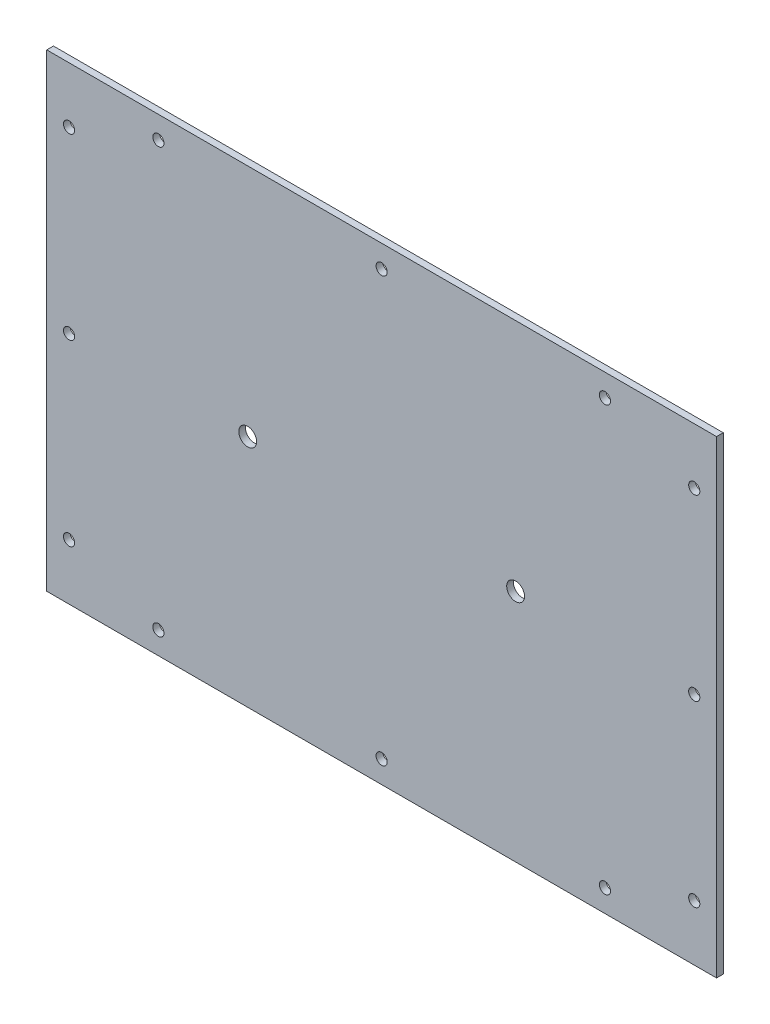
ISO-10303-21;
HEADER;
FILE_DESCRIPTION(('STEP AP214'),'2;1');
FILE_NAME('part.step','',(''),(''),'','','');
FILE_SCHEMA(('AUTOMOTIVE_DESIGN { 1 0 10303 214 1 1 1 1 }'));
ENDSEC;
DATA;
#1=APPLICATION_CONTEXT('core data for automotive mechanical design processes');
#2=APPLICATION_PROTOCOL_DEFINITION('international standard','automotive_design',2000,#1);
#3=PRODUCT_CONTEXT('',#1,'mechanical');
#4=PRODUCT('Part','Part','',(#3));
#5=PRODUCT_RELATED_PRODUCT_CATEGORY('part','',(#4));
#6=PRODUCT_DEFINITION_FORMATION('','',#4);
#7=PRODUCT_DEFINITION_CONTEXT('part definition',#1,'design');
#8=PRODUCT_DEFINITION('design','',#6,#7);
#9=PRODUCT_DEFINITION_SHAPE('','',#8);
#10=(LENGTH_UNIT() NAMED_UNIT(*) SI_UNIT(.MILLI.,.METRE.));
#11=(NAMED_UNIT(*) PLANE_ANGLE_UNIT() SI_UNIT($,.RADIAN.));
#12=(NAMED_UNIT(*) SI_UNIT($,.STERADIAN.) SOLID_ANGLE_UNIT());
#13=UNCERTAINTY_MEASURE_WITH_UNIT(LENGTH_MEASURE(1.E-05),#10,'distance_accuracy_value','');
#14=(GEOMETRIC_REPRESENTATION_CONTEXT(3) GLOBAL_UNCERTAINTY_ASSIGNED_CONTEXT((#13)) GLOBAL_UNIT_ASSIGNED_CONTEXT((#10,
#11,#12)) REPRESENTATION_CONTEXT('',''));
#15=CARTESIAN_POINT('',(0.,0.,0.));
#16=DIRECTION('',(0.,0.,1.));
#17=DIRECTION('',(1.,0.,0.));
#18=AXIS2_PLACEMENT_3D('',#15,#16,#17);
#19=CARTESIAN_POINT('',(150.,105.,3.));
#20=DIRECTION('',(-1.,0.,0.));
#21=DIRECTION('',(0.,0.,1.));
#22=AXIS2_PLACEMENT_3D('',#19,#20,#21);
#23=PLANE('',#22);
#24=DIRECTION('',(0.,1.,0.));
#25=VECTOR('',#24,1.);
#26=CARTESIAN_POINT('',(150.,105.,0.));
#27=LINE('',#26,#25);
#28=CARTESIAN_POINT('',(150.,-105.,0.));
#29=VERTEX_POINT('',#28);
#30=CARTESIAN_POINT('',(150.,105.,0.));
#31=VERTEX_POINT('',#30);
#32=EDGE_CURVE('E109',#29,#31,#27,.T.);
#33=ORIENTED_EDGE('',*,*,#32,.T.);
#34=DIRECTION('',(0.,0.,-1.));
#35=VECTOR('',#34,1.);
#36=CARTESIAN_POINT('',(150.,105.,3.));
#37=LINE('',#36,#35);
#38=CARTESIAN_POINT('',(150.,105.,3.));
#39=VERTEX_POINT('',#38);
#40=EDGE_CURVE('E11',#39,#31,#37,.T.);
#41=ORIENTED_EDGE('',*,*,#40,.F.);
#42=DIRECTION('',(0.,1.,0.));
#43=VECTOR('',#42,1.);
#44=CARTESIAN_POINT('',(150.,105.,3.));
#45=LINE('',#44,#43);
#46=CARTESIAN_POINT('',(150.,-105.,3.));
#47=VERTEX_POINT('',#46);
#48=EDGE_CURVE('E93',#47,#39,#45,.T.);
#49=ORIENTED_EDGE('',*,*,#48,.F.);
#50=DIRECTION('',(0.,0.,-1.));
#51=VECTOR('',#50,1.);
#52=CARTESIAN_POINT('',(150.,-105.,3.));
#53=LINE('',#52,#51);
#54=EDGE_CURVE('E105',#47,#29,#53,.T.);
#55=ORIENTED_EDGE('',*,*,#54,.T.);
#56=EDGE_LOOP('',(#33,#41,#49,#55));
#57=FACE_BOUND('',#56,.T.);
#58=ADVANCED_FACE('F41',(#57),#23,.F.);
#59=CARTESIAN_POINT('',(-150.,105.,3.));
#60=DIRECTION('',(0.,-1.,0.));
#61=DIRECTION('',(0.,0.,-1.));
#62=AXIS2_PLACEMENT_3D('',#59,#60,#61);
#63=PLANE('',#62);
#64=DIRECTION('',(-1.,0.,0.));
#65=VECTOR('',#64,1.);
#66=CARTESIAN_POINT('',(-150.,105.,0.));
#67=LINE('',#66,#65);
#68=CARTESIAN_POINT('',(-150.,105.,0.));
#69=VERTEX_POINT('',#68);
#70=EDGE_CURVE('E98',#31,#69,#67,.T.);
#71=ORIENTED_EDGE('',*,*,#70,.T.);
#72=DIRECTION('',(0.,0.,-1.));
#73=VECTOR('',#72,1.);
#74=CARTESIAN_POINT('',(-150.,105.,3.));
#75=LINE('',#74,#73);
#76=CARTESIAN_POINT('',(-150.,105.,3.));
#77=VERTEX_POINT('',#76);
#78=EDGE_CURVE('E50',#77,#69,#75,.T.);
#79=ORIENTED_EDGE('',*,*,#78,.F.);
#80=DIRECTION('',(-1.,0.,0.));
#81=VECTOR('',#80,1.);
#82=CARTESIAN_POINT('',(-150.,105.,3.));
#83=LINE('',#82,#81);
#84=EDGE_CURVE('E88',#39,#77,#83,.T.);
#85=ORIENTED_EDGE('',*,*,#84,.F.);
#86=ORIENTED_EDGE('',*,*,#40,.T.);
#87=EDGE_LOOP('',(#71,#79,#85,#86));
#88=FACE_BOUND('',#87,.T.);
#89=ADVANCED_FACE('F97',(#88),#63,.F.);
#90=CARTESIAN_POINT('',(-150.,105.,3.));
#91=DIRECTION('',(1.,0.,0.));
#92=DIRECTION('',(0.,1.,0.));
#93=AXIS2_PLACEMENT_3D('',#90,#91,#92);
#94=PLANE('',#93);
#95=DIRECTION('',(0.,-1.,0.));
#96=VECTOR('',#95,1.);
#97=CARTESIAN_POINT('',(-150.,105.,0.));
#98=LINE('',#97,#96);
#99=CARTESIAN_POINT('',(-150.,-105.,0.));
#100=VERTEX_POINT('',#99);
#101=EDGE_CURVE('E75',#69,#100,#98,.T.);
#102=ORIENTED_EDGE('',*,*,#101,.T.);
#103=DIRECTION('',(0.,0.,-1.));
#104=VECTOR('',#103,1.);
#105=CARTESIAN_POINT('',(-150.,-105.,3.));
#106=LINE('',#105,#104);
#107=CARTESIAN_POINT('',(-150.,-105.,3.));
#108=VERTEX_POINT('',#107);
#109=EDGE_CURVE('E100',#108,#100,#106,.T.);
#110=ORIENTED_EDGE('',*,*,#109,.F.);
#111=DIRECTION('',(0.,-1.,0.));
#112=VECTOR('',#111,1.);
#113=CARTESIAN_POINT('',(-150.,105.,3.));
#114=LINE('',#113,#112);
#115=EDGE_CURVE('E91',#77,#108,#114,.T.);
#116=ORIENTED_EDGE('',*,*,#115,.F.);
#117=ORIENTED_EDGE('',*,*,#78,.T.);
#118=EDGE_LOOP('',(#102,#110,#116,#117));
#119=FACE_BOUND('',#118,.T.);
#120=ADVANCED_FACE('F101',(#119),#94,.F.);
#121=CARTESIAN_POINT('',(-150.,-105.,3.));
#122=DIRECTION('',(0.,1.,0.));
#123=DIRECTION('',(0.,0.,1.));
#124=AXIS2_PLACEMENT_3D('',#121,#122,#123);
#125=PLANE('',#124);
#126=DIRECTION('',(1.,0.,0.));
#127=VECTOR('',#126,1.);
#128=CARTESIAN_POINT('',(-150.,-105.,0.));
#129=LINE('',#128,#127);
#130=EDGE_CURVE('E81',#100,#29,#129,.T.);
#131=ORIENTED_EDGE('',*,*,#130,.T.);
#132=ORIENTED_EDGE('',*,*,#54,.F.);
#133=DIRECTION('',(1.,0.,0.));
#134=VECTOR('',#133,1.);
#135=CARTESIAN_POINT('',(-150.,-105.,3.));
#136=LINE('',#135,#134);
#137=EDGE_CURVE('E58',#108,#47,#136,.T.);
#138=ORIENTED_EDGE('',*,*,#137,.F.);
#139=ORIENTED_EDGE('',*,*,#109,.T.);
#140=EDGE_LOOP('',(#131,#132,#138,#139));
#141=FACE_BOUND('',#140,.T.);
#142=ADVANCED_FACE('F123',(#141),#125,.F.);
#143=CARTESIAN_POINT('',(0.,0.,3.));
#144=DIRECTION('',(0.,0.,1.));
#145=DIRECTION('',(1.,0.,0.));
#146=AXIS2_PLACEMENT_3D('',#143,#144,#145);
#147=PLANE('',#146);
#148=CARTESIAN_POINT('',(60.,0.,3.));
#149=DIRECTION('',(0.,0.,1.));
#150=DIRECTION('',(1.,0.,0.));
#151=AXIS2_PLACEMENT_3D('',#148,#149,#150);
#152=CIRCLE('',#151,4.00000000000001);
#153=CARTESIAN_POINT('',(64.,0.,3.));
#154=VERTEX_POINT('',#153);
#155=EDGE_CURVE('E234',#154,#154,#152,.T.);
#156=ORIENTED_EDGE('',*,*,#155,.F.);
#157=EDGE_LOOP('',(#156));
#158=FACE_BOUND('',#157,.T.);
#159=CARTESIAN_POINT('',(-60.,0.,3.));
#160=DIRECTION('',(0.,0.,1.));
#161=DIRECTION('',(1.,0.,0.));
#162=AXIS2_PLACEMENT_3D('',#159,#160,#161);
#163=CIRCLE('',#162,4.00000000000001);
#164=CARTESIAN_POINT('',(-56.,0.,3.));
#165=VERTEX_POINT('',#164);
#166=EDGE_CURVE('E226',#165,#165,#163,.T.);
#167=ORIENTED_EDGE('',*,*,#166,.F.);
#168=EDGE_LOOP('',(#167));
#169=FACE_BOUND('',#168,.T.);
#170=CARTESIAN_POINT('',(139.999999999999,-80.,3.));
#171=DIRECTION('',(0.,0.,1.));
#172=DIRECTION('',(-1.,0.,0.));
#173=AXIS2_PLACEMENT_3D('',#170,#171,#172);
#174=CIRCLE('',#173,2.5);
#175=CARTESIAN_POINT('',(137.499999999999,-80.,3.));
#176=VERTEX_POINT('',#175);
#177=EDGE_CURVE('E147',#176,#176,#174,.T.);
#178=ORIENTED_EDGE('',*,*,#177,.F.);
#179=EDGE_LOOP('',(#178));
#180=FACE_BOUND('',#179,.T.);
#181=CARTESIAN_POINT('',(140.,80.,3.));
#182=DIRECTION('',(0.,0.,1.));
#183=DIRECTION('',(-1.,0.,0.));
#184=AXIS2_PLACEMENT_3D('',#181,#182,#183);
#185=CIRCLE('',#184,2.5);
#186=CARTESIAN_POINT('',(137.5,80.,3.));
#187=VERTEX_POINT('',#186);
#188=EDGE_CURVE('E138',#187,#187,#185,.T.);
#189=ORIENTED_EDGE('',*,*,#188,.F.);
#190=EDGE_LOOP('',(#189));
#191=FACE_BOUND('',#190,.T.);
#192=CARTESIAN_POINT('',(139.999999999999,0.,3.));
#193=DIRECTION('',(0.,0.,1.));
#194=DIRECTION('',(-1.,0.,0.));
#195=AXIS2_PLACEMENT_3D('',#192,#193,#194);
#196=CIRCLE('',#195,2.5);
#197=CARTESIAN_POINT('',(137.499999999999,0.,3.));
#198=VERTEX_POINT('',#197);
#199=EDGE_CURVE('E156',#198,#198,#196,.T.);
#200=ORIENTED_EDGE('',*,*,#199,.F.);
#201=EDGE_LOOP('',(#200));
#202=FACE_BOUND('',#201,.T.);
#203=CARTESIAN_POINT('',(100.,-95.,3.));
#204=DIRECTION('',(0.,0.,1.));
#205=DIRECTION('',(-1.,0.,0.));
#206=AXIS2_PLACEMENT_3D('',#203,#204,#205);
#207=CIRCLE('',#206,2.5);
#208=CARTESIAN_POINT('',(97.5,-95.,3.));
#209=VERTEX_POINT('',#208);
#210=EDGE_CURVE('E189',#209,#209,#207,.T.);
#211=ORIENTED_EDGE('',*,*,#210,.F.);
#212=EDGE_LOOP('',(#211));
#213=FACE_BOUND('',#212,.T.);
#214=CARTESIAN_POINT('',(-100.,-94.9999999999993,3.));
#215=DIRECTION('',(0.,0.,1.));
#216=DIRECTION('',(-1.,0.,0.));
#217=AXIS2_PLACEMENT_3D('',#214,#215,#216);
#218=CIRCLE('',#217,2.5);
#219=CARTESIAN_POINT('',(-102.5,-94.9999999999993,3.));
#220=VERTEX_POINT('',#219);
#221=EDGE_CURVE('E181',#220,#220,#218,.T.);
#222=ORIENTED_EDGE('',*,*,#221,.F.);
#223=EDGE_LOOP('',(#222));
#224=FACE_BOUND('',#223,.T.);
#225=CARTESIAN_POINT('',(-140.,0.,3.));
#226=DIRECTION('',(0.,0.,1.));
#227=DIRECTION('',(1.,0.,0.));
#228=AXIS2_PLACEMENT_3D('',#225,#226,#227);
#229=CIRCLE('',#228,2.5);
#230=CARTESIAN_POINT('',(-137.5,0.,3.));
#231=VERTEX_POINT('',#230);
#232=EDGE_CURVE('E173',#231,#231,#229,.T.);
#233=ORIENTED_EDGE('',*,*,#232,.F.);
#234=EDGE_LOOP('',(#233));
#235=FACE_BOUND('',#234,.T.);
#236=CARTESIAN_POINT('',(100.,95.,3.));
#237=DIRECTION('',(0.,0.,1.));
#238=DIRECTION('',(1.,0.,0.));
#239=AXIS2_PLACEMENT_3D('',#236,#237,#238);
#240=CIRCLE('',#239,2.5);
#241=CARTESIAN_POINT('',(102.5,95.,3.));
#242=VERTEX_POINT('',#241);
#243=EDGE_CURVE('E164',#242,#242,#240,.T.);
#244=ORIENTED_EDGE('',*,*,#243,.F.);
#245=EDGE_LOOP('',(#244));
#246=FACE_BOUND('',#245,.T.);
#247=CARTESIAN_POINT('',(-100.,94.9999999999993,3.));
#248=DIRECTION('',(0.,0.,1.));
#249=DIRECTION('',(1.,0.,0.));
#250=AXIS2_PLACEMENT_3D('',#247,#248,#249);
#251=CIRCLE('',#250,2.5);
#252=CARTESIAN_POINT('',(-97.5,94.9999999999993,3.));
#253=VERTEX_POINT('',#252);
#254=EDGE_CURVE('E219',#253,#253,#251,.T.);
#255=ORIENTED_EDGE('',*,*,#254,.F.);
#256=EDGE_LOOP('',(#255));
#257=FACE_BOUND('',#256,.T.);
#258=CARTESIAN_POINT('',(-140.,80.,3.));
#259=DIRECTION('',(0.,0.,1.));
#260=DIRECTION('',(1.,0.,0.));
#261=AXIS2_PLACEMENT_3D('',#258,#259,#260);
#262=CIRCLE('',#261,2.5);
#263=CARTESIAN_POINT('',(-137.5,80.,3.));
#264=VERTEX_POINT('',#263);
#265=EDGE_CURVE('E211',#264,#264,#262,.T.);
#266=ORIENTED_EDGE('',*,*,#265,.F.);
#267=EDGE_LOOP('',(#266));
#268=FACE_BOUND('',#267,.T.);
#269=CARTESIAN_POINT('',(-139.999999999999,-80.,3.));
#270=DIRECTION('',(0.,0.,1.));
#271=DIRECTION('',(1.,0.,0.));
#272=AXIS2_PLACEMENT_3D('',#269,#270,#271);
#273=CIRCLE('',#272,2.5);
#274=CARTESIAN_POINT('',(-137.499999999999,-80.,3.));
#275=VERTEX_POINT('',#274);
#276=EDGE_CURVE('E203',#275,#275,#273,.T.);
#277=ORIENTED_EDGE('',*,*,#276,.F.);
#278=EDGE_LOOP('',(#277));
#279=FACE_BOUND('',#278,.T.);
#280=CARTESIAN_POINT('',(0.,-95.,3.));
#281=DIRECTION('',(0.,0.,1.));
#282=DIRECTION('',(-1.,0.,0.));
#283=AXIS2_PLACEMENT_3D('',#280,#281,#282);
#284=CIRCLE('',#283,2.5);
#285=CARTESIAN_POINT('',(-2.5,-95.,3.));
#286=VERTEX_POINT('',#285);
#287=EDGE_CURVE('E155',#286,#286,#284,.T.);
#288=ORIENTED_EDGE('',*,*,#287,.F.);
#289=EDGE_LOOP('',(#288));
#290=FACE_BOUND('',#289,.T.);
#291=CARTESIAN_POINT('',(0.,95.,3.));
#292=DIRECTION('',(0.,0.,1.));
#293=DIRECTION('',(1.,0.,0.));
#294=AXIS2_PLACEMENT_3D('',#291,#292,#293);
#295=CIRCLE('',#294,2.5);
#296=CARTESIAN_POINT('',(2.5,95.,3.));
#297=VERTEX_POINT('',#296);
#298=EDGE_CURVE('E130',#297,#297,#295,.T.);
#299=ORIENTED_EDGE('',*,*,#298,.F.);
#300=EDGE_LOOP('',(#299));
#301=FACE_BOUND('',#300,.T.);
#302=ORIENTED_EDGE('',*,*,#48,.T.);
#303=ORIENTED_EDGE('',*,*,#84,.T.);
#304=ORIENTED_EDGE('',*,*,#115,.T.);
#305=ORIENTED_EDGE('',*,*,#137,.T.);
#306=EDGE_LOOP('',(#302,#303,#304,#305));
#307=FACE_BOUND('',#306,.T.);
#308=ADVANCED_FACE('F89',(#158,#169,#180,#191,#202,#213,#224,#235,#246,#257,#268,#279,#290,#301,
#307),#147,.T.);
#309=CARTESIAN_POINT('',(0.,0.,0.));
#310=DIRECTION('',(0.,0.,1.));
#311=DIRECTION('',(1.,0.,0.));
#312=AXIS2_PLACEMENT_3D('',#309,#310,#311);
#313=PLANE('',#312);
#314=CARTESIAN_POINT('',(60.,0.,0.));
#315=DIRECTION('',(0.,0.,1.));
#316=DIRECTION('',(1.,0.,0.));
#317=AXIS2_PLACEMENT_3D('',#314,#315,#316);
#318=CIRCLE('',#317,4.00000000000001);
#319=CARTESIAN_POINT('',(64.,0.,0.));
#320=VERTEX_POINT('',#319);
#321=EDGE_CURVE('E160',#320,#320,#318,.T.);
#322=ORIENTED_EDGE('',*,*,#321,.T.);
#323=EDGE_LOOP('',(#322));
#324=FACE_BOUND('',#323,.T.);
#325=CARTESIAN_POINT('',(-60.,0.,0.));
#326=DIRECTION('',(0.,0.,1.));
#327=DIRECTION('',(1.,0.,0.));
#328=AXIS2_PLACEMENT_3D('',#325,#326,#327);
#329=CIRCLE('',#328,4.00000000000001);
#330=CARTESIAN_POINT('',(-56.,0.,0.));
#331=VERTEX_POINT('',#330);
#332=EDGE_CURVE('E230',#331,#331,#329,.T.);
#333=ORIENTED_EDGE('',*,*,#332,.T.);
#334=EDGE_LOOP('',(#333));
#335=FACE_BOUND('',#334,.T.);
#336=CARTESIAN_POINT('',(139.999999999999,-80.,0.));
#337=DIRECTION('',(0.,0.,1.));
#338=DIRECTION('',(-1.,0.,0.));
#339=AXIS2_PLACEMENT_3D('',#336,#337,#338);
#340=CIRCLE('',#339,2.5);
#341=CARTESIAN_POINT('',(137.499999999999,-80.,0.));
#342=VERTEX_POINT('',#341);
#343=EDGE_CURVE('E151',#342,#342,#340,.T.);
#344=ORIENTED_EDGE('',*,*,#343,.T.);
#345=EDGE_LOOP('',(#344));
#346=FACE_BOUND('',#345,.T.);
#347=CARTESIAN_POINT('',(140.,80.,0.));
#348=DIRECTION('',(0.,0.,1.));
#349=DIRECTION('',(-1.,0.,0.));
#350=AXIS2_PLACEMENT_3D('',#347,#348,#349);
#351=CIRCLE('',#350,2.5);
#352=CARTESIAN_POINT('',(137.5,80.,0.));
#353=VERTEX_POINT('',#352);
#354=EDGE_CURVE('E142',#353,#353,#351,.T.);
#355=ORIENTED_EDGE('',*,*,#354,.T.);
#356=EDGE_LOOP('',(#355));
#357=FACE_BOUND('',#356,.T.);
#358=CARTESIAN_POINT('',(139.999999999999,0.,0.));
#359=DIRECTION('',(0.,0.,1.));
#360=DIRECTION('',(-1.,0.,0.));
#361=AXIS2_PLACEMENT_3D('',#358,#359,#360);
#362=CIRCLE('',#361,2.5);
#363=CARTESIAN_POINT('',(137.499999999999,0.,0.));
#364=VERTEX_POINT('',#363);
#365=EDGE_CURVE('E143',#364,#364,#362,.T.);
#366=ORIENTED_EDGE('',*,*,#365,.T.);
#367=EDGE_LOOP('',(#366));
#368=FACE_BOUND('',#367,.T.);
#369=CARTESIAN_POINT('',(100.,-95.,0.));
#370=DIRECTION('',(0.,0.,1.));
#371=DIRECTION('',(-1.,0.,0.));
#372=AXIS2_PLACEMENT_3D('',#369,#370,#371);
#373=CIRCLE('',#372,2.5);
#374=CARTESIAN_POINT('',(97.5,-95.,0.));
#375=VERTEX_POINT('',#374);
#376=EDGE_CURVE('E134',#375,#375,#373,.T.);
#377=ORIENTED_EDGE('',*,*,#376,.T.);
#378=EDGE_LOOP('',(#377));
#379=FACE_BOUND('',#378,.T.);
#380=CARTESIAN_POINT('',(-100.,-94.9999999999993,0.));
#381=DIRECTION('',(0.,0.,1.));
#382=DIRECTION('',(-1.,0.,0.));
#383=AXIS2_PLACEMENT_3D('',#380,#381,#382);
#384=CIRCLE('',#383,2.5);
#385=CARTESIAN_POINT('',(-102.5,-94.9999999999993,0.));
#386=VERTEX_POINT('',#385);
#387=EDGE_CURVE('E185',#386,#386,#384,.T.);
#388=ORIENTED_EDGE('',*,*,#387,.T.);
#389=EDGE_LOOP('',(#388));
#390=FACE_BOUND('',#389,.T.);
#391=CARTESIAN_POINT('',(-140.,0.,0.));
#392=DIRECTION('',(0.,0.,1.));
#393=DIRECTION('',(1.,0.,0.));
#394=AXIS2_PLACEMENT_3D('',#391,#392,#393);
#395=CIRCLE('',#394,2.5);
#396=CARTESIAN_POINT('',(-137.5,0.,0.));
#397=VERTEX_POINT('',#396);
#398=EDGE_CURVE('E177',#397,#397,#395,.T.);
#399=ORIENTED_EDGE('',*,*,#398,.T.);
#400=EDGE_LOOP('',(#399));
#401=FACE_BOUND('',#400,.T.);
#402=CARTESIAN_POINT('',(100.,95.,0.));
#403=DIRECTION('',(0.,0.,1.));
#404=DIRECTION('',(1.,0.,0.));
#405=AXIS2_PLACEMENT_3D('',#402,#403,#404);
#406=CIRCLE('',#405,2.5);
#407=CARTESIAN_POINT('',(102.5,95.,0.));
#408=VERTEX_POINT('',#407);
#409=EDGE_CURVE('E168',#408,#408,#406,.T.);
#410=ORIENTED_EDGE('',*,*,#409,.T.);
#411=EDGE_LOOP('',(#410));
#412=FACE_BOUND('',#411,.T.);
#413=CARTESIAN_POINT('',(-100.,94.9999999999993,0.));
#414=DIRECTION('',(0.,0.,1.));
#415=DIRECTION('',(1.,0.,0.));
#416=AXIS2_PLACEMENT_3D('',#413,#414,#415);
#417=CIRCLE('',#416,2.5);
#418=CARTESIAN_POINT('',(-97.5,94.9999999999993,0.));
#419=VERTEX_POINT('',#418);
#420=EDGE_CURVE('E169',#419,#419,#417,.T.);
#421=ORIENTED_EDGE('',*,*,#420,.T.);
#422=EDGE_LOOP('',(#421));
#423=FACE_BOUND('',#422,.T.);
#424=CARTESIAN_POINT('',(-140.,80.,0.));
#425=DIRECTION('',(0.,0.,1.));
#426=DIRECTION('',(1.,0.,0.));
#427=AXIS2_PLACEMENT_3D('',#424,#425,#426);
#428=CIRCLE('',#427,2.5);
#429=CARTESIAN_POINT('',(-137.5,80.,0.));
#430=VERTEX_POINT('',#429);
#431=EDGE_CURVE('E215',#430,#430,#428,.T.);
#432=ORIENTED_EDGE('',*,*,#431,.T.);
#433=EDGE_LOOP('',(#432));
#434=FACE_BOUND('',#433,.T.);
#435=CARTESIAN_POINT('',(-139.999999999999,-80.,0.));
#436=DIRECTION('',(0.,0.,1.));
#437=DIRECTION('',(1.,0.,0.));
#438=AXIS2_PLACEMENT_3D('',#435,#436,#437);
#439=CIRCLE('',#438,2.5);
#440=CARTESIAN_POINT('',(-137.499999999999,-80.,0.));
#441=VERTEX_POINT('',#440);
#442=EDGE_CURVE('E207',#441,#441,#439,.T.);
#443=ORIENTED_EDGE('',*,*,#442,.T.);
#444=EDGE_LOOP('',(#443));
#445=FACE_BOUND('',#444,.T.);
#446=CARTESIAN_POINT('',(0.,-95.,0.));
#447=DIRECTION('',(0.,0.,1.));
#448=DIRECTION('',(-1.,0.,0.));
#449=AXIS2_PLACEMENT_3D('',#446,#447,#448);
#450=CIRCLE('',#449,2.5);
#451=CARTESIAN_POINT('',(-2.5,-95.,0.));
#452=VERTEX_POINT('',#451);
#453=EDGE_CURVE('E199',#452,#452,#450,.T.);
#454=ORIENTED_EDGE('',*,*,#453,.T.);
#455=EDGE_LOOP('',(#454));
#456=FACE_BOUND('',#455,.T.);
#457=CARTESIAN_POINT('',(0.,95.,0.));
#458=DIRECTION('',(0.,0.,1.));
#459=DIRECTION('',(1.,0.,0.));
#460=AXIS2_PLACEMENT_3D('',#457,#458,#459);
#461=CIRCLE('',#460,2.5);
#462=CARTESIAN_POINT('',(2.5,95.,0.));
#463=VERTEX_POINT('',#462);
#464=EDGE_CURVE('E113',#463,#463,#461,.T.);
#465=ORIENTED_EDGE('',*,*,#464,.T.);
#466=EDGE_LOOP('',(#465));
#467=FACE_BOUND('',#466,.T.);
#468=ORIENTED_EDGE('',*,*,#32,.F.);
#469=ORIENTED_EDGE('',*,*,#130,.F.);
#470=ORIENTED_EDGE('',*,*,#101,.F.);
#471=ORIENTED_EDGE('',*,*,#70,.F.);
#472=EDGE_LOOP('',(#468,#469,#470,#471));
#473=FACE_BOUND('',#472,.T.);
#474=ADVANCED_FACE('F126',(#324,#335,#346,#357,#368,#379,#390,#401,#412,#423,#434,#445,#456,
#467,#473),#313,.F.);
#475=CARTESIAN_POINT('',(0.,95.,0.));
#476=DIRECTION('',(0.,0.,1.));
#477=DIRECTION('',(1.,0.,0.));
#478=AXIS2_PLACEMENT_3D('',#475,#476,#477);
#479=CYLINDRICAL_SURFACE('',#478,2.5);
#480=ORIENTED_EDGE('',*,*,#464,.F.);
#481=EDGE_LOOP('',(#480));
#482=FACE_BOUND('',#481,.T.);
#483=ORIENTED_EDGE('',*,*,#298,.T.);
#484=EDGE_LOOP('',(#483));
#485=FACE_BOUND('',#484,.T.);
#486=ADVANCED_FACE('F280',(#482,#485),#479,.F.);
#487=CARTESIAN_POINT('',(0.,-95.,0.));
#488=DIRECTION('',(0.,0.,1.));
#489=DIRECTION('',(1.,0.,0.));
#490=AXIS2_PLACEMENT_3D('',#487,#488,#489);
#491=CYLINDRICAL_SURFACE('',#490,2.5);
#492=ORIENTED_EDGE('',*,*,#453,.F.);
#493=EDGE_LOOP('',(#492));
#494=FACE_BOUND('',#493,.T.);
#495=ORIENTED_EDGE('',*,*,#287,.T.);
#496=EDGE_LOOP('',(#495));
#497=FACE_BOUND('',#496,.T.);
#498=ADVANCED_FACE('F282',(#494,#497),#491,.F.);
#499=CARTESIAN_POINT('',(-139.999999999999,-80.,0.));
#500=DIRECTION('',(0.,0.,1.));
#501=DIRECTION('',(1.,0.,0.));
#502=AXIS2_PLACEMENT_3D('',#499,#500,#501);
#503=CYLINDRICAL_SURFACE('',#502,2.5);
#504=ORIENTED_EDGE('',*,*,#442,.F.);
#505=EDGE_LOOP('',(#504));
#506=FACE_BOUND('',#505,.T.);
#507=ORIENTED_EDGE('',*,*,#276,.T.);
#508=EDGE_LOOP('',(#507));
#509=FACE_BOUND('',#508,.T.);
#510=ADVANCED_FACE('F289',(#506,#509),#503,.F.);
#511=CARTESIAN_POINT('',(-140.,80.,0.));
#512=DIRECTION('',(0.,0.,1.));
#513=DIRECTION('',(1.,0.,0.));
#514=AXIS2_PLACEMENT_3D('',#511,#512,#513);
#515=CYLINDRICAL_SURFACE('',#514,2.5);
#516=ORIENTED_EDGE('',*,*,#431,.F.);
#517=EDGE_LOOP('',(#516));
#518=FACE_BOUND('',#517,.T.);
#519=ORIENTED_EDGE('',*,*,#265,.T.);
#520=EDGE_LOOP('',(#519));
#521=FACE_BOUND('',#520,.T.);
#522=ADVANCED_FACE('F397',(#518,#521),#515,.F.);
#523=CARTESIAN_POINT('',(-100.,94.9999999999993,0.));
#524=DIRECTION('',(0.,0.,1.));
#525=DIRECTION('',(1.,0.,0.));
#526=AXIS2_PLACEMENT_3D('',#523,#524,#525);
#527=CYLINDRICAL_SURFACE('',#526,2.5);
#528=ORIENTED_EDGE('',*,*,#420,.F.);
#529=EDGE_LOOP('',(#528));
#530=FACE_BOUND('',#529,.T.);
#531=ORIENTED_EDGE('',*,*,#254,.T.);
#532=EDGE_LOOP('',(#531));
#533=FACE_BOUND('',#532,.T.);
#534=ADVANCED_FACE('F389',(#530,#533),#527,.F.);
#535=CARTESIAN_POINT('',(100.,95.,0.));
#536=DIRECTION('',(0.,0.,1.));
#537=DIRECTION('',(1.,0.,0.));
#538=AXIS2_PLACEMENT_3D('',#535,#536,#537);
#539=CYLINDRICAL_SURFACE('',#538,2.5);
#540=ORIENTED_EDGE('',*,*,#409,.F.);
#541=EDGE_LOOP('',(#540));
#542=FACE_BOUND('',#541,.T.);
#543=ORIENTED_EDGE('',*,*,#243,.T.);
#544=EDGE_LOOP('',(#543));
#545=FACE_BOUND('',#544,.T.);
#546=ADVANCED_FACE('F381',(#542,#545),#539,.F.);
#547=CARTESIAN_POINT('',(-140.,0.,0.));
#548=DIRECTION('',(0.,0.,1.));
#549=DIRECTION('',(1.,0.,0.));
#550=AXIS2_PLACEMENT_3D('',#547,#548,#549);
#551=CYLINDRICAL_SURFACE('',#550,2.5);
#552=ORIENTED_EDGE('',*,*,#398,.F.);
#553=EDGE_LOOP('',(#552));
#554=FACE_BOUND('',#553,.T.);
#555=ORIENTED_EDGE('',*,*,#232,.T.);
#556=EDGE_LOOP('',(#555));
#557=FACE_BOUND('',#556,.T.);
#558=ADVANCED_FACE('F373',(#554,#557),#551,.F.);
#559=CARTESIAN_POINT('',(-100.,-94.9999999999993,0.));
#560=DIRECTION('',(0.,0.,1.));
#561=DIRECTION('',(1.,0.,0.));
#562=AXIS2_PLACEMENT_3D('',#559,#560,#561);
#563=CYLINDRICAL_SURFACE('',#562,2.5);
#564=ORIENTED_EDGE('',*,*,#387,.F.);
#565=EDGE_LOOP('',(#564));
#566=FACE_BOUND('',#565,.T.);
#567=ORIENTED_EDGE('',*,*,#221,.T.);
#568=EDGE_LOOP('',(#567));
#569=FACE_BOUND('',#568,.T.);
#570=ADVANCED_FACE('F365',(#566,#569),#563,.F.);
#571=CARTESIAN_POINT('',(100.,-95.,0.));
#572=DIRECTION('',(0.,0.,1.));
#573=DIRECTION('',(1.,0.,0.));
#574=AXIS2_PLACEMENT_3D('',#571,#572,#573);
#575=CYLINDRICAL_SURFACE('',#574,2.5);
#576=ORIENTED_EDGE('',*,*,#376,.F.);
#577=EDGE_LOOP('',(#576));
#578=FACE_BOUND('',#577,.T.);
#579=ORIENTED_EDGE('',*,*,#210,.T.);
#580=EDGE_LOOP('',(#579));
#581=FACE_BOUND('',#580,.T.);
#582=ADVANCED_FACE('F357',(#578,#581),#575,.F.);
#583=CARTESIAN_POINT('',(139.999999999999,0.,0.));
#584=DIRECTION('',(0.,0.,1.));
#585=DIRECTION('',(1.,0.,0.));
#586=AXIS2_PLACEMENT_3D('',#583,#584,#585);
#587=CYLINDRICAL_SURFACE('',#586,2.5);
#588=ORIENTED_EDGE('',*,*,#365,.F.);
#589=EDGE_LOOP('',(#588));
#590=FACE_BOUND('',#589,.T.);
#591=ORIENTED_EDGE('',*,*,#199,.T.);
#592=EDGE_LOOP('',(#591));
#593=FACE_BOUND('',#592,.T.);
#594=ADVANCED_FACE('F350',(#590,#593),#587,.F.);
#595=CARTESIAN_POINT('',(140.,80.,0.));
#596=DIRECTION('',(0.,0.,1.));
#597=DIRECTION('',(1.,0.,0.));
#598=AXIS2_PLACEMENT_3D('',#595,#596,#597);
#599=CYLINDRICAL_SURFACE('',#598,2.5);
#600=ORIENTED_EDGE('',*,*,#354,.F.);
#601=EDGE_LOOP('',(#600));
#602=FACE_BOUND('',#601,.T.);
#603=ORIENTED_EDGE('',*,*,#188,.T.);
#604=EDGE_LOOP('',(#603));
#605=FACE_BOUND('',#604,.T.);
#606=ADVANCED_FACE('F343',(#602,#605),#599,.F.);
#607=CARTESIAN_POINT('',(139.999999999999,-80.,0.));
#608=DIRECTION('',(0.,0.,1.));
#609=DIRECTION('',(1.,0.,0.));
#610=AXIS2_PLACEMENT_3D('',#607,#608,#609);
#611=CYLINDRICAL_SURFACE('',#610,2.5);
#612=ORIENTED_EDGE('',*,*,#343,.F.);
#613=EDGE_LOOP('',(#612));
#614=FACE_BOUND('',#613,.T.);
#615=ORIENTED_EDGE('',*,*,#177,.T.);
#616=EDGE_LOOP('',(#615));
#617=FACE_BOUND('',#616,.T.);
#618=ADVANCED_FACE('F328',(#614,#617),#611,.F.);
#619=CARTESIAN_POINT('',(-60.,0.,0.));
#620=DIRECTION('',(0.,0.,1.));
#621=DIRECTION('',(1.,0.,0.));
#622=AXIS2_PLACEMENT_3D('',#619,#620,#621);
#623=CYLINDRICAL_SURFACE('',#622,4.00000000000001);
#624=ORIENTED_EDGE('',*,*,#332,.F.);
#625=EDGE_LOOP('',(#624));
#626=FACE_BOUND('',#625,.T.);
#627=ORIENTED_EDGE('',*,*,#166,.T.);
#628=EDGE_LOOP('',(#627));
#629=FACE_BOUND('',#628,.T.);
#630=ADVANCED_FACE('F247',(#626,#629),#623,.F.);
#631=CARTESIAN_POINT('',(60.,0.,0.));
#632=DIRECTION('',(0.,0.,1.));
#633=DIRECTION('',(1.,0.,0.));
#634=AXIS2_PLACEMENT_3D('',#631,#632,#633);
#635=CYLINDRICAL_SURFACE('',#634,4.00000000000001);
#636=ORIENTED_EDGE('',*,*,#321,.F.);
#637=EDGE_LOOP('',(#636));
#638=FACE_BOUND('',#637,.T.);
#639=ORIENTED_EDGE('',*,*,#155,.T.);
#640=EDGE_LOOP('',(#639));
#641=FACE_BOUND('',#640,.T.);
#642=ADVANCED_FACE('F244',(#638,#641),#635,.F.);
#643=CLOSED_SHELL('',(#58,#89,#120,#142,#308,#474,#486,#498,#510,#522,#534,#546,#558,#570,#582,
#594,#606,#618,#630,#642));
#644=MANIFOLD_SOLID_BREP('B2',#643);
#645=ADVANCED_BREP_SHAPE_REPRESENTATION('',(#18,#644),#14);
#646=SHAPE_DEFINITION_REPRESENTATION(#9,#645);
ENDSEC;
END-ISO-10303-21;
